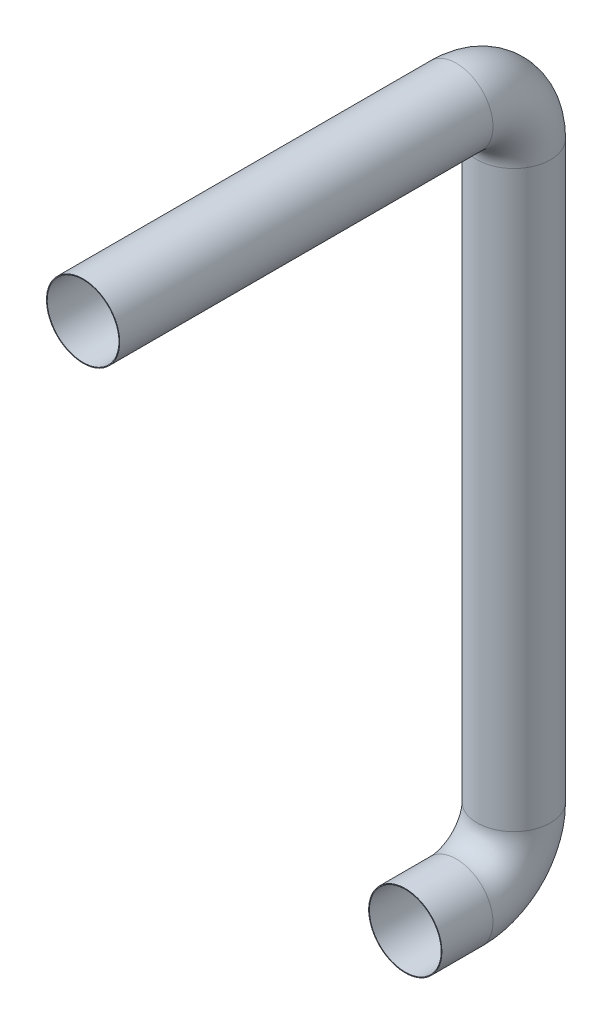
ISO-10303-21;
HEADER;
FILE_DESCRIPTION(('STEP AP214'),'2;1');
FILE_NAME('part.step','',(''),(''),'','','');
FILE_SCHEMA(('AUTOMOTIVE_DESIGN { 1 0 10303 214 1 1 1 1 }'));
ENDSEC;
DATA;
#1=APPLICATION_CONTEXT('core data for automotive mechanical design processes');
#2=APPLICATION_PROTOCOL_DEFINITION('international standard','automotive_design',2000,#1);
#3=PRODUCT_CONTEXT('',#1,'mechanical');
#4=PRODUCT('Part','Part','',(#3));
#5=PRODUCT_RELATED_PRODUCT_CATEGORY('part','',(#4));
#6=PRODUCT_DEFINITION_FORMATION('','',#4);
#7=PRODUCT_DEFINITION_CONTEXT('part definition',#1,'design');
#8=PRODUCT_DEFINITION('design','',#6,#7);
#9=PRODUCT_DEFINITION_SHAPE('','',#8);
#10=(LENGTH_UNIT() NAMED_UNIT(*) SI_UNIT(.MILLI.,.METRE.));
#11=(NAMED_UNIT(*) PLANE_ANGLE_UNIT() SI_UNIT($,.RADIAN.));
#12=(NAMED_UNIT(*) SI_UNIT($,.STERADIAN.) SOLID_ANGLE_UNIT());
#13=UNCERTAINTY_MEASURE_WITH_UNIT(LENGTH_MEASURE(1.E-05),#10,'distance_accuracy_value','');
#14=(GEOMETRIC_REPRESENTATION_CONTEXT(3) GLOBAL_UNCERTAINTY_ASSIGNED_CONTEXT((#13)) GLOBAL_UNIT_ASSIGNED_CONTEXT((#10,
#11,#12)) REPRESENTATION_CONTEXT('',''));
#15=CARTESIAN_POINT('',(0.,0.,0.));
#16=DIRECTION('',(0.,0.,1.));
#17=DIRECTION('',(1.,0.,0.));
#18=AXIS2_PLACEMENT_3D('',#15,#16,#17);
#19=CARTESIAN_POINT('',(0.,0.,0.));
#20=DIRECTION('',(0.,0.,-1.));
#21=DIRECTION('',(-1.,0.,0.));
#22=AXIS2_PLACEMENT_3D('',#19,#20,#21);
#23=CYLINDRICAL_SURFACE('',#22,25.5);
#24=CARTESIAN_POINT('',(0.,0.,-260.));
#25=DIRECTION('',(0.,0.,1.));
#26=DIRECTION('',(1.,0.,0.));
#27=AXIS2_PLACEMENT_3D('',#24,#25,#26);
#28=CIRCLE('',#27,25.5);
#29=CARTESIAN_POINT('',(0.,25.5,-260.));
#30=VERTEX_POINT('',#29);
#31=EDGE_CURVE('E65',#30,#30,#28,.T.);
#32=ORIENTED_EDGE('',*,*,#31,.T.);
#33=EDGE_LOOP('',(#32));
#34=FACE_BOUND('',#33,.T.);
#35=CARTESIAN_POINT('',(0.,0.,0.));
#36=DIRECTION('',(0.,0.,1.));
#37=DIRECTION('',(1.,0.,0.));
#38=AXIS2_PLACEMENT_3D('',#35,#36,#37);
#39=CIRCLE('',#38,25.5);
#40=CARTESIAN_POINT('',(25.5,0.,0.));
#41=VERTEX_POINT('',#40);
#42=EDGE_CURVE('E61',#41,#41,#39,.T.);
#43=ORIENTED_EDGE('',*,*,#42,.F.);
#44=EDGE_LOOP('',(#43));
#45=FACE_BOUND('',#44,.T.);
#46=ADVANCED_FACE('F37',(#34,#45),#23,.T.);
#47=CARTESIAN_POINT('',(0.,-40.,-260.));
#48=DIRECTION('',(-1.,0.,0.));
#49=DIRECTION('',(0.,0.,1.));
#50=AXIS2_PLACEMENT_3D('',#47,#48,#49);
#51=TOROIDAL_SURFACE('',#50,40.,25.5);
#52=CARTESIAN_POINT('',(0.,-40.,-300.));
#53=DIRECTION('',(0.,1.,0.));
#54=DIRECTION('',(1.,0.,0.));
#55=AXIS2_PLACEMENT_3D('',#52,#53,#54);
#56=CIRCLE('',#55,25.5);
#57=CARTESIAN_POINT('',(0.,-40.,-325.5));
#58=VERTEX_POINT('',#57);
#59=EDGE_CURVE('E69',#58,#58,#56,.T.);
#60=CARTESIAN_POINT('',(0.,-40.,-260.));
#61=DIRECTION('',(-1.,0.,0.));
#62=DIRECTION('',(0.,0.,1.));
#63=AXIS2_PLACEMENT_3D('',#60,#61,#62);
#64=CIRCLE('',#63,65.5);
#65=EDGE_CURVE('',#30,#58,#64,.T.);
#66=ORIENTED_EDGE('',*,*,#31,.F.);
#67=ORIENTED_EDGE('',*,*,#59,.T.);
#68=ORIENTED_EDGE('',*,*,#65,.T.);
#69=ORIENTED_EDGE('',*,*,#65,.F.);
#70=EDGE_LOOP('',(#66,#68,#67,#69));
#71=FACE_BOUND('',#70,.T.);
#72=ADVANCED_FACE('F114',(#71),#51,.T.);
#73=CARTESIAN_POINT('',(0.,-40.,-300.));
#74=DIRECTION('',(0.,-1.,0.));
#75=DIRECTION('',(0.,0.,-1.));
#76=AXIS2_PLACEMENT_3D('',#73,#74,#75);
#77=CYLINDRICAL_SURFACE('',#76,25.5);
#78=CARTESIAN_POINT('',(0.,-440.,-300.));
#79=DIRECTION('',(0.,1.,0.));
#80=DIRECTION('',(1.,0.,0.));
#81=AXIS2_PLACEMENT_3D('',#78,#79,#80);
#82=CIRCLE('',#81,25.5);
#83=CARTESIAN_POINT('',(0.,-440.,-325.5));
#84=VERTEX_POINT('',#83);
#85=EDGE_CURVE('E72',#84,#84,#82,.T.);
#86=ORIENTED_EDGE('',*,*,#85,.T.);
#87=EDGE_LOOP('',(#86));
#88=FACE_BOUND('',#87,.T.);
#89=ORIENTED_EDGE('',*,*,#59,.F.);
#90=EDGE_LOOP('',(#89));
#91=FACE_BOUND('',#90,.T.);
#92=ADVANCED_FACE('F94',(#88,#91),#77,.T.);
#93=CARTESIAN_POINT('',(0.,-440.,-260.));
#94=DIRECTION('',(-1.,0.,0.));
#95=DIRECTION('',(0.,0.,1.));
#96=AXIS2_PLACEMENT_3D('',#93,#94,#95);
#97=TOROIDAL_SURFACE('',#96,40.,25.5);
#98=CARTESIAN_POINT('',(0.,-480.,-260.));
#99=DIRECTION('',(0.,0.,-1.));
#100=DIRECTION('',(1.,0.,0.));
#101=AXIS2_PLACEMENT_3D('',#98,#99,#100);
#102=CIRCLE('',#101,25.5);
#103=CARTESIAN_POINT('',(0.,-505.5,-260.));
#104=VERTEX_POINT('',#103);
#105=EDGE_CURVE('E41',#104,#104,#102,.T.);
#106=CARTESIAN_POINT('',(0.,-440.,-260.));
#107=DIRECTION('',(-1.,0.,0.));
#108=DIRECTION('',(0.,0.,1.));
#109=AXIS2_PLACEMENT_3D('',#106,#107,#108);
#110=CIRCLE('',#109,65.5);
#111=EDGE_CURVE('',#84,#104,#110,.T.);
#112=ORIENTED_EDGE('',*,*,#85,.F.);
#113=ORIENTED_EDGE('',*,*,#105,.T.);
#114=ORIENTED_EDGE('',*,*,#111,.T.);
#115=ORIENTED_EDGE('',*,*,#111,.F.);
#116=EDGE_LOOP('',(#112,#114,#113,#115));
#117=FACE_BOUND('',#116,.T.);
#118=ADVANCED_FACE('F81',(#117),#97,.T.);
#119=CARTESIAN_POINT('',(0.,-480.,-260.));
#120=DIRECTION('',(0.,0.,1.));
#121=DIRECTION('',(1.,0.,0.));
#122=AXIS2_PLACEMENT_3D('',#119,#120,#121);
#123=CYLINDRICAL_SURFACE('',#122,25.5);
#124=CARTESIAN_POINT('',(0.,-480.,-224.43));
#125=DIRECTION('',(0.,0.,-1.));
#126=DIRECTION('',(1.,0.,0.));
#127=AXIS2_PLACEMENT_3D('',#124,#125,#126);
#128=CIRCLE('',#127,25.5);
#129=CARTESIAN_POINT('',(25.5,-480.,-224.43));
#130=VERTEX_POINT('',#129);
#131=EDGE_CURVE('E56',#130,#130,#128,.T.);
#132=ORIENTED_EDGE('',*,*,#131,.T.);
#133=EDGE_LOOP('',(#132));
#134=FACE_BOUND('',#133,.T.);
#135=ORIENTED_EDGE('',*,*,#105,.F.);
#136=EDGE_LOOP('',(#135));
#137=FACE_BOUND('',#136,.T.);
#138=ADVANCED_FACE('F39',(#134,#137),#123,.T.);
#139=CARTESIAN_POINT('',(0.,0.,0.));
#140=DIRECTION('',(0.,0.,1.));
#141=DIRECTION('',(1.,0.,0.));
#142=AXIS2_PLACEMENT_3D('',#139,#140,#141);
#143=PLANE('',#142);
#144=CARTESIAN_POINT('',(0.,0.,0.));
#145=DIRECTION('',(0.,0.,1.));
#146=DIRECTION('',(1.,0.,0.));
#147=AXIS2_PLACEMENT_3D('',#144,#145,#146);
#148=CIRCLE('',#147,25.);
#149=CARTESIAN_POINT('',(25.,0.,0.));
#150=VERTEX_POINT('',#149);
#151=EDGE_CURVE('E60',#150,#150,#148,.F.);
#152=ORIENTED_EDGE('',*,*,#151,.T.);
#153=EDGE_LOOP('',(#152));
#154=FACE_BOUND('',#153,.T.);
#155=ORIENTED_EDGE('',*,*,#42,.T.);
#156=EDGE_LOOP('',(#155));
#157=FACE_BOUND('',#156,.T.);
#158=ADVANCED_FACE('F85',(#154,#157),#143,.T.);
#159=CARTESIAN_POINT('',(0.,-480.,-224.43));
#160=DIRECTION('',(0.,0.,-1.));
#161=DIRECTION('',(1.,0.,0.));
#162=AXIS2_PLACEMENT_3D('',#159,#160,#161);
#163=PLANE('',#162);
#164=CARTESIAN_POINT('',(0.,-480.,-224.43));
#165=DIRECTION('',(0.,0.,-1.));
#166=DIRECTION('',(1.,0.,0.));
#167=AXIS2_PLACEMENT_3D('',#164,#165,#166);
#168=CIRCLE('',#167,25.);
#169=CARTESIAN_POINT('',(25.,-480.,-224.43));
#170=VERTEX_POINT('',#169);
#171=EDGE_CURVE('E10',#170,#170,#168,.F.);
#172=ORIENTED_EDGE('',*,*,#171,.F.);
#173=EDGE_LOOP('',(#172));
#174=FACE_BOUND('',#173,.T.);
#175=ORIENTED_EDGE('',*,*,#131,.F.);
#176=EDGE_LOOP('',(#175));
#177=FACE_BOUND('',#176,.T.);
#178=ADVANCED_FACE('F91',(#174,#177),#163,.F.);
#179=CARTESIAN_POINT('',(0.,0.,0.));
#180=DIRECTION('',(0.,0.,-1.));
#181=DIRECTION('',(-1.,0.,0.));
#182=AXIS2_PLACEMENT_3D('',#179,#180,#181);
#183=CYLINDRICAL_SURFACE('',#182,25.);
#184=CARTESIAN_POINT('',(0.,0.,-260.));
#185=DIRECTION('',(0.,0.,1.));
#186=DIRECTION('',(1.,0.,0.));
#187=AXIS2_PLACEMENT_3D('',#184,#185,#186);
#188=CIRCLE('',#187,25.);
#189=CARTESIAN_POINT('',(0.,25.,-260.));
#190=VERTEX_POINT('',#189);
#191=EDGE_CURVE('E199',#190,#190,#188,.F.);
#192=ORIENTED_EDGE('',*,*,#191,.T.);
#193=EDGE_LOOP('',(#192));
#194=FACE_BOUND('',#193,.T.);
#195=ORIENTED_EDGE('',*,*,#151,.F.);
#196=EDGE_LOOP('',(#195));
#197=FACE_BOUND('',#196,.T.);
#198=ADVANCED_FACE('F109',(#194,#197),#183,.F.);
#199=CARTESIAN_POINT('',(0.,-40.,-260.));
#200=DIRECTION('',(-1.,0.,0.));
#201=DIRECTION('',(0.,0.,1.));
#202=AXIS2_PLACEMENT_3D('',#199,#200,#201);
#203=TOROIDAL_SURFACE('',#202,40.,25.);
#204=CARTESIAN_POINT('',(0.,-40.,-300.));
#205=DIRECTION('',(0.,1.,0.));
#206=DIRECTION('',(1.,0.,0.));
#207=AXIS2_PLACEMENT_3D('',#204,#205,#206);
#208=CIRCLE('',#207,25.);
#209=CARTESIAN_POINT('',(0.,-40.,-325.));
#210=VERTEX_POINT('',#209);
#211=EDGE_CURVE('E197',#210,#210,#208,.F.);
#212=CARTESIAN_POINT('',(0.,-40.,-260.));
#213=DIRECTION('',(-1.,0.,0.));
#214=DIRECTION('',(0.,0.,1.));
#215=AXIS2_PLACEMENT_3D('',#212,#213,#214);
#216=CIRCLE('',#215,65.);
#217=EDGE_CURVE('',#190,#210,#216,.T.);
#218=ORIENTED_EDGE('',*,*,#191,.F.);
#219=ORIENTED_EDGE('',*,*,#211,.T.);
#220=ORIENTED_EDGE('',*,*,#217,.T.);
#221=ORIENTED_EDGE('',*,*,#217,.F.);
#222=EDGE_LOOP('',(#218,#220,#219,#221));
#223=FACE_BOUND('',#222,.T.);
#224=ADVANCED_FACE('F160',(#223),#203,.F.);
#225=CARTESIAN_POINT('',(0.,-40.,-300.));
#226=DIRECTION('',(0.,-1.,0.));
#227=DIRECTION('',(0.,0.,-1.));
#228=AXIS2_PLACEMENT_3D('',#225,#226,#227);
#229=CYLINDRICAL_SURFACE('',#228,25.);
#230=CARTESIAN_POINT('',(0.,-440.,-300.));
#231=DIRECTION('',(0.,1.,0.));
#232=DIRECTION('',(1.,0.,0.));
#233=AXIS2_PLACEMENT_3D('',#230,#231,#232);
#234=CIRCLE('',#233,25.);
#235=CARTESIAN_POINT('',(0.,-440.,-325.));
#236=VERTEX_POINT('',#235);
#237=EDGE_CURVE('E52',#236,#236,#234,.F.);
#238=ORIENTED_EDGE('',*,*,#237,.T.);
#239=EDGE_LOOP('',(#238));
#240=FACE_BOUND('',#239,.T.);
#241=ORIENTED_EDGE('',*,*,#211,.F.);
#242=EDGE_LOOP('',(#241));
#243=FACE_BOUND('',#242,.T.);
#244=ADVANCED_FACE('F102',(#240,#243),#229,.F.);
#245=CARTESIAN_POINT('',(0.,-440.,-260.));
#246=DIRECTION('',(-1.,0.,0.));
#247=DIRECTION('',(0.,0.,1.));
#248=AXIS2_PLACEMENT_3D('',#245,#246,#247);
#249=TOROIDAL_SURFACE('',#248,40.,25.);
#250=CARTESIAN_POINT('',(0.,-480.,-260.));
#251=DIRECTION('',(0.,0.,-1.));
#252=DIRECTION('',(1.,0.,0.));
#253=AXIS2_PLACEMENT_3D('',#250,#251,#252);
#254=CIRCLE('',#253,25.);
#255=CARTESIAN_POINT('',(0.,-505.,-260.));
#256=VERTEX_POINT('',#255);
#257=EDGE_CURVE('E46',#256,#256,#254,.F.);
#258=CARTESIAN_POINT('',(0.,-440.,-260.));
#259=DIRECTION('',(-1.,0.,0.));
#260=DIRECTION('',(0.,0.,1.));
#261=AXIS2_PLACEMENT_3D('',#258,#259,#260);
#262=CIRCLE('',#261,65.);
#263=EDGE_CURVE('',#236,#256,#262,.T.);
#264=ORIENTED_EDGE('',*,*,#237,.F.);
#265=ORIENTED_EDGE('',*,*,#257,.T.);
#266=ORIENTED_EDGE('',*,*,#263,.T.);
#267=ORIENTED_EDGE('',*,*,#263,.F.);
#268=EDGE_LOOP('',(#264,#266,#265,#267));
#269=FACE_BOUND('',#268,.T.);
#270=ADVANCED_FACE('F97',(#269),#249,.F.);
#271=CARTESIAN_POINT('',(0.,-480.,-260.));
#272=DIRECTION('',(0.,0.,1.));
#273=DIRECTION('',(1.,0.,0.));
#274=AXIS2_PLACEMENT_3D('',#271,#272,#273);
#275=CYLINDRICAL_SURFACE('',#274,25.);
#276=ORIENTED_EDGE('',*,*,#171,.T.);
#277=EDGE_LOOP('',(#276));
#278=FACE_BOUND('',#277,.T.);
#279=ORIENTED_EDGE('',*,*,#257,.F.);
#280=EDGE_LOOP('',(#279));
#281=FACE_BOUND('',#280,.T.);
#282=ADVANCED_FACE('F95',(#278,#281),#275,.F.);
#283=CLOSED_SHELL('',(#46,#72,#92,#118,#138,#158,#178,#198,#224,#244,#270,#282));
#284=MANIFOLD_SOLID_BREP('B2',#283);
#285=ADVANCED_BREP_SHAPE_REPRESENTATION('',(#18,#284),#14);
#286=SHAPE_DEFINITION_REPRESENTATION(#9,#285);
ENDSEC;
END-ISO-10303-21;
